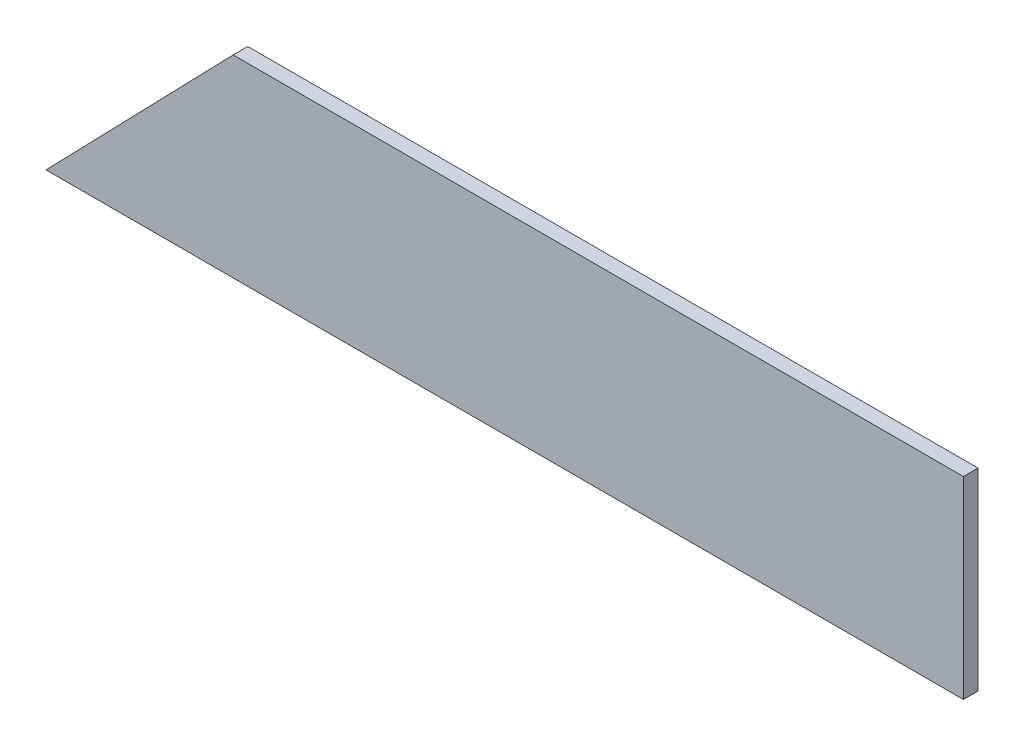
ISO-10303-21;
HEADER;
FILE_DESCRIPTION(('STEP AP214'),'2;1');
FILE_NAME('part.step','',(''),(''),'','','');
FILE_SCHEMA(('AUTOMOTIVE_DESIGN { 1 0 10303 214 1 1 1 1 }'));
ENDSEC;
DATA;
#1=APPLICATION_CONTEXT('core data for automotive mechanical design processes');
#2=APPLICATION_PROTOCOL_DEFINITION('international standard','automotive_design',2000,#1);
#3=PRODUCT_CONTEXT('',#1,'mechanical');
#4=PRODUCT('Part','Part','',(#3));
#5=PRODUCT_RELATED_PRODUCT_CATEGORY('part','',(#4));
#6=PRODUCT_DEFINITION_FORMATION('','',#4);
#7=PRODUCT_DEFINITION_CONTEXT('part definition',#1,'design');
#8=PRODUCT_DEFINITION('design','',#6,#7);
#9=PRODUCT_DEFINITION_SHAPE('','',#8);
#10=(LENGTH_UNIT() NAMED_UNIT(*) SI_UNIT(.MILLI.,.METRE.));
#11=(NAMED_UNIT(*) PLANE_ANGLE_UNIT() SI_UNIT($,.RADIAN.));
#12=(NAMED_UNIT(*) SI_UNIT($,.STERADIAN.) SOLID_ANGLE_UNIT());
#13=UNCERTAINTY_MEASURE_WITH_UNIT(LENGTH_MEASURE(1.E-05),#10,'distance_accuracy_value','');
#14=(GEOMETRIC_REPRESENTATION_CONTEXT(3) GLOBAL_UNCERTAINTY_ASSIGNED_CONTEXT((#13)) GLOBAL_UNIT_ASSIGNED_CONTEXT((#10,
#11,#12)) REPRESENTATION_CONTEXT('',''));
#15=CARTESIAN_POINT('',(0.,0.,0.));
#16=DIRECTION('',(0.,0.,1.));
#17=DIRECTION('',(1.,0.,0.));
#18=AXIS2_PLACEMENT_3D('',#15,#16,#17);
#19=CARTESIAN_POINT('',(807.349115044248,190.893362831858,18.25625));
#20=DIRECTION('',(-1.,0.,0.));
#21=DIRECTION('',(0.,0.,1.));
#22=AXIS2_PLACEMENT_3D('',#19,#20,#21);
#23=PLANE('',#22);
#24=DIRECTION('',(0.,1.,0.));
#25=VECTOR('',#24,1.);
#26=CARTESIAN_POINT('',(807.349115044248,190.893362831858,0.));
#27=LINE('',#26,#25);
#28=CARTESIAN_POINT('',(807.349115044248,-50.4066371681416,0.));
#29=VERTEX_POINT('',#28);
#30=CARTESIAN_POINT('',(807.349115044248,190.893362831858,0.));
#31=VERTEX_POINT('',#30);
#32=EDGE_CURVE('E95',#29,#31,#27,.T.);
#33=ORIENTED_EDGE('',*,*,#32,.T.);
#34=DIRECTION('',(0.,0.,-1.));
#35=VECTOR('',#34,1.);
#36=CARTESIAN_POINT('',(807.349115044248,190.893362831858,18.25625));
#37=LINE('',#36,#35);
#38=CARTESIAN_POINT('',(807.349115044248,190.893362831858,18.25625));
#39=VERTEX_POINT('',#38);
#40=EDGE_CURVE('E11',#39,#31,#37,.T.);
#41=ORIENTED_EDGE('',*,*,#40,.F.);
#42=DIRECTION('',(0.,1.,0.));
#43=VECTOR('',#42,1.);
#44=CARTESIAN_POINT('',(807.349115044248,190.893362831858,18.25625));
#45=LINE('',#44,#43);
#46=CARTESIAN_POINT('',(807.349115044248,-50.4066371681416,18.25625));
#47=VERTEX_POINT('',#46);
#48=EDGE_CURVE('E83',#47,#39,#45,.T.);
#49=ORIENTED_EDGE('',*,*,#48,.F.);
#50=DIRECTION('',(0.,0.,-1.));
#51=VECTOR('',#50,1.);
#52=CARTESIAN_POINT('',(807.349115044248,-50.4066371681416,18.25625));
#53=LINE('',#52,#51);
#54=EDGE_CURVE('E91',#47,#29,#53,.T.);
#55=ORIENTED_EDGE('',*,*,#54,.T.);
#56=EDGE_LOOP('',(#33,#41,#49,#55));
#57=FACE_BOUND('',#56,.T.);
#58=ADVANCED_FACE('F32',(#57),#23,.F.);
#59=CARTESIAN_POINT('',(-104.989917186891,190.893362831858,18.25625));
#60=DIRECTION('',(0.,-1.,0.));
#61=DIRECTION('',(0.,0.,-1.));
#62=AXIS2_PLACEMENT_3D('',#59,#60,#61);
#63=PLANE('',#62);
#64=DIRECTION('',(-1.,0.,0.));
#65=VECTOR('',#64,1.);
#66=CARTESIAN_POINT('',(-104.989917186891,190.893362831858,0.));
#67=LINE('',#66,#65);
#68=CARTESIAN_POINT('',(-104.989917186891,190.893362831858,0.));
#69=VERTEX_POINT('',#68);
#70=EDGE_CURVE('E87',#31,#69,#67,.T.);
#71=ORIENTED_EDGE('',*,*,#70,.T.);
#72=DIRECTION('',(0.,0.,-1.));
#73=VECTOR('',#72,1.);
#74=CARTESIAN_POINT('',(-104.989917186891,190.893362831858,18.25625));
#75=LINE('',#74,#73);
#76=CARTESIAN_POINT('',(-104.989917186891,190.893362831858,18.25625));
#77=VERTEX_POINT('',#76);
#78=EDGE_CURVE('E40',#77,#69,#75,.T.);
#79=ORIENTED_EDGE('',*,*,#78,.F.);
#80=DIRECTION('',(-1.,0.,0.));
#81=VECTOR('',#80,1.);
#82=CARTESIAN_POINT('',(-104.989917186891,190.893362831858,18.25625));
#83=LINE('',#82,#81);
#84=EDGE_CURVE('E78',#39,#77,#83,.T.);
#85=ORIENTED_EDGE('',*,*,#84,.F.);
#86=ORIENTED_EDGE('',*,*,#40,.T.);
#87=EDGE_LOOP('',(#71,#79,#85,#86));
#88=FACE_BOUND('',#87,.T.);
#89=ADVANCED_FACE('F86',(#88),#63,.F.);
#90=CARTESIAN_POINT('',(-338.825884955752,-50.4066371681416,18.25625));
#91=DIRECTION('',(0.71812629776319,-0.695912796592313,0.));
#92=DIRECTION('',(0.695912796592313,0.71812629776319,0.));
#93=AXIS2_PLACEMENT_3D('',#90,#91,#92);
#94=PLANE('',#93);
#95=DIRECTION('',(-0.695912796592313,-0.71812629776319,0.));
#96=VECTOR('',#95,1.);
#97=CARTESIAN_POINT('',(-338.825884955752,-50.4066371681416,0.));
#98=LINE('',#97,#96);
#99=CARTESIAN_POINT('',(-338.825884955752,-50.4066371681416,0.));
#100=VERTEX_POINT('',#99);
#101=EDGE_CURVE('E65',#69,#100,#98,.T.);
#102=ORIENTED_EDGE('',*,*,#101,.T.);
#103=DIRECTION('',(0.,0.,-1.));
#104=VECTOR('',#103,1.);
#105=CARTESIAN_POINT('',(-338.825884955752,-50.4066371681416,18.25625));
#106=LINE('',#105,#104);
#107=CARTESIAN_POINT('',(-338.825884955752,-50.4066371681416,18.25625));
#108=VERTEX_POINT('',#107);
#109=EDGE_CURVE('E88',#108,#100,#106,.T.);
#110=ORIENTED_EDGE('',*,*,#109,.F.);
#111=DIRECTION('',(-0.695912796592313,-0.71812629776319,0.));
#112=VECTOR('',#111,1.);
#113=CARTESIAN_POINT('',(-338.825884955752,-50.4066371681416,18.25625));
#114=LINE('',#113,#112);
#115=EDGE_CURVE('E81',#77,#108,#114,.T.);
#116=ORIENTED_EDGE('',*,*,#115,.F.);
#117=ORIENTED_EDGE('',*,*,#78,.T.);
#118=EDGE_LOOP('',(#102,#110,#116,#117));
#119=FACE_BOUND('',#118,.T.);
#120=ADVANCED_FACE('F89',(#119),#94,.F.);
#121=CARTESIAN_POINT('',(-338.825884955752,-50.4066371681416,18.25625));
#122=DIRECTION('',(0.,1.,0.));
#123=DIRECTION('',(0.,0.,1.));
#124=AXIS2_PLACEMENT_3D('',#121,#122,#123);
#125=PLANE('',#124);
#126=DIRECTION('',(1.,0.,0.));
#127=VECTOR('',#126,1.);
#128=CARTESIAN_POINT('',(-338.825884955752,-50.4066371681416,0.));
#129=LINE('',#128,#127);
#130=EDGE_CURVE('E71',#100,#29,#129,.T.);
#131=ORIENTED_EDGE('',*,*,#130,.T.);
#132=ORIENTED_EDGE('',*,*,#54,.F.);
#133=DIRECTION('',(1.,0.,0.));
#134=VECTOR('',#133,1.);
#135=CARTESIAN_POINT('',(-338.825884955752,-50.4066371681416,18.25625));
#136=LINE('',#135,#134);
#137=EDGE_CURVE('E48',#108,#47,#136,.T.);
#138=ORIENTED_EDGE('',*,*,#137,.F.);
#139=ORIENTED_EDGE('',*,*,#109,.T.);
#140=EDGE_LOOP('',(#131,#132,#138,#139));
#141=FACE_BOUND('',#140,.T.);
#142=ADVANCED_FACE('F102',(#141),#125,.F.);
#143=CARTESIAN_POINT('',(0.,0.,18.25625));
#144=DIRECTION('',(0.,0.,1.));
#145=DIRECTION('',(1.,0.,0.));
#146=AXIS2_PLACEMENT_3D('',#143,#144,#145);
#147=PLANE('',#146);
#148=ORIENTED_EDGE('',*,*,#48,.T.);
#149=ORIENTED_EDGE('',*,*,#84,.T.);
#150=ORIENTED_EDGE('',*,*,#115,.T.);
#151=ORIENTED_EDGE('',*,*,#137,.T.);
#152=EDGE_LOOP('',(#148,#149,#150,#151));
#153=FACE_BOUND('',#152,.T.);
#154=ADVANCED_FACE('F79',(#153),#147,.T.);
#155=CARTESIAN_POINT('',(0.,0.,0.));
#156=DIRECTION('',(0.,0.,1.));
#157=DIRECTION('',(1.,0.,0.));
#158=AXIS2_PLACEMENT_3D('',#155,#156,#157);
#159=PLANE('',#158);
#160=ORIENTED_EDGE('',*,*,#32,.F.);
#161=ORIENTED_EDGE('',*,*,#130,.F.);
#162=ORIENTED_EDGE('',*,*,#101,.F.);
#163=ORIENTED_EDGE('',*,*,#70,.F.);
#164=EDGE_LOOP('',(#160,#161,#162,#163));
#165=FACE_BOUND('',#164,.T.);
#166=ADVANCED_FACE('F105',(#165),#159,.F.);
#167=CLOSED_SHELL('',(#58,#89,#120,#142,#154,#166));
#168=MANIFOLD_SOLID_BREP('B2',#167);
#169=ADVANCED_BREP_SHAPE_REPRESENTATION('',(#18,#168),#14);
#170=SHAPE_DEFINITION_REPRESENTATION(#9,#169);
ENDSEC;
END-ISO-10303-21;
